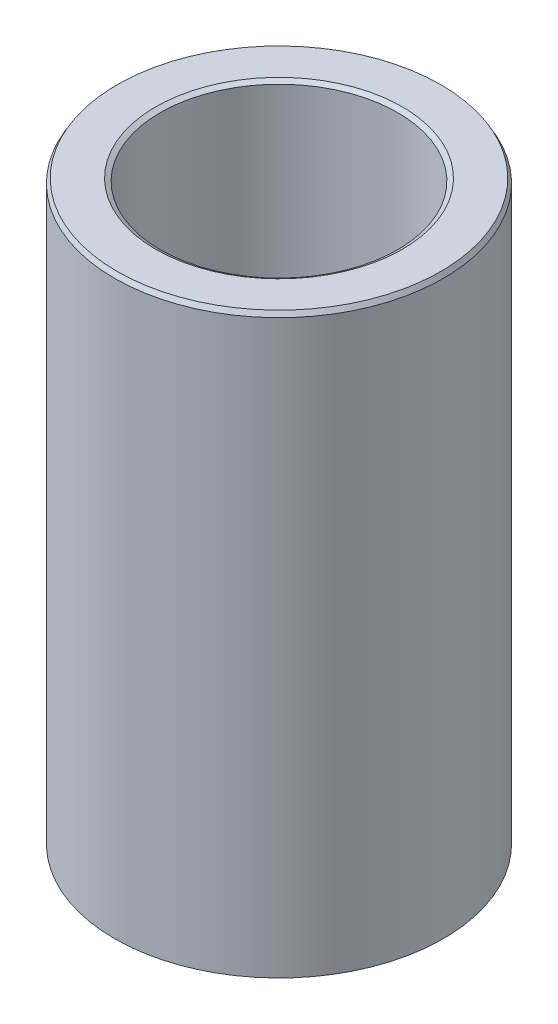
ISO-10303-21;
HEADER;
FILE_DESCRIPTION(('STEP AP214'),'2;1');
FILE_NAME('part.step','',(''),(''),'','','');
FILE_SCHEMA(('AUTOMOTIVE_DESIGN { 1 0 10303 214 1 1 1 1 }'));
ENDSEC;
DATA;
#1=APPLICATION_CONTEXT('core data for automotive mechanical design processes');
#2=APPLICATION_PROTOCOL_DEFINITION('international standard','automotive_design',2000,#1);
#3=PRODUCT_CONTEXT('',#1,'mechanical');
#4=PRODUCT('Part','Part','',(#3));
#5=PRODUCT_RELATED_PRODUCT_CATEGORY('part','',(#4));
#6=PRODUCT_DEFINITION_FORMATION('','',#4);
#7=PRODUCT_DEFINITION_CONTEXT('part definition',#1,'design');
#8=PRODUCT_DEFINITION('design','',#6,#7);
#9=PRODUCT_DEFINITION_SHAPE('','',#8);
#10=(LENGTH_UNIT() NAMED_UNIT(*) SI_UNIT(.MILLI.,.METRE.));
#11=(NAMED_UNIT(*) PLANE_ANGLE_UNIT() SI_UNIT($,.RADIAN.));
#12=(NAMED_UNIT(*) SI_UNIT($,.STERADIAN.) SOLID_ANGLE_UNIT());
#13=UNCERTAINTY_MEASURE_WITH_UNIT(LENGTH_MEASURE(1.E-05),#10,'distance_accuracy_value','');
#14=(GEOMETRIC_REPRESENTATION_CONTEXT(3) GLOBAL_UNCERTAINTY_ASSIGNED_CONTEXT((#13)) GLOBAL_UNIT_ASSIGNED_CONTEXT((#10,
#11,#12)) REPRESENTATION_CONTEXT('',''));
#15=CARTESIAN_POINT('',(0.,0.,0.));
#16=DIRECTION('',(0.,0.,1.));
#17=DIRECTION('',(1.,0.,0.));
#18=AXIS2_PLACEMENT_3D('',#15,#16,#17);
#19=CARTESIAN_POINT('',(0.,167.271061436816,0.));
#20=DIRECTION('',(0.,-1.,0.));
#21=DIRECTION('',(0.,0.,-1.));
#22=AXIS2_PLACEMENT_3D('',#19,#20,#21);
#23=CYLINDRICAL_SURFACE('',#22,47.5);
#24=CARTESIAN_POINT('',(0.,0.77125485827173,0.));
#25=DIRECTION('',(0.,1.,0.));
#26=DIRECTION('',(0.,0.,1.));
#27=AXIS2_PLACEMENT_3D('',#24,#25,#26);
#28=CIRCLE('',#27,47.5);
#29=CARTESIAN_POINT('',(0.,0.77125485827173,47.5));
#30=VERTEX_POINT('',#29);
#31=EDGE_CURVE('E10',#30,#30,#28,.T.);
#32=ORIENTED_EDGE('',*,*,#31,.T.);
#33=EDGE_LOOP('',(#32));
#34=FACE_BOUND('',#33,.T.);
#35=CARTESIAN_POINT('',(0.,165.935208836705,0.));
#36=DIRECTION('',(0.,1.,0.));
#37=DIRECTION('',(0.,0.,1.));
#38=AXIS2_PLACEMENT_3D('',#35,#36,#37);
#39=CIRCLE('',#38,47.5);
#40=CARTESIAN_POINT('',(0.,165.935208836705,47.5));
#41=VERTEX_POINT('',#40);
#42=EDGE_CURVE('E50',#41,#41,#39,.F.);
#43=ORIENTED_EDGE('',*,*,#42,.T.);
#44=EDGE_LOOP('',(#43));
#45=FACE_BOUND('',#44,.T.);
#46=ADVANCED_FACE('F39',(#34,#45),#23,.T.);
#47=CARTESIAN_POINT('',(0.,167.271061436816,0.));
#48=DIRECTION('',(0.,1.,0.));
#49=DIRECTION('',(0.,0.,1.));
#50=AXIS2_PLACEMENT_3D('',#47,#48,#49);
#51=PLANE('',#50);
#52=CARTESIAN_POINT('',(0.,167.271061436816,0.));
#53=DIRECTION('',(0.,1.,0.));
#54=DIRECTION('',(0.,0.,1.));
#55=AXIS2_PLACEMENT_3D('',#52,#53,#54);
#56=CIRCLE('',#55,35.6332214592748);
#57=CARTESIAN_POINT('',(0.,167.271061436816,35.6332214592748));
#58=VERTEX_POINT('',#57);
#59=EDGE_CURVE('E58',#58,#58,#56,.F.);
#60=ORIENTED_EDGE('',*,*,#59,.T.);
#61=EDGE_LOOP('',(#60));
#62=FACE_BOUND('',#61,.T.);
#63=CARTESIAN_POINT('',(0.,167.271061436816,0.));
#64=DIRECTION('',(0.,1.,0.));
#65=DIRECTION('',(0.,0.,1.));
#66=AXIS2_PLACEMENT_3D('',#63,#64,#65);
#67=CIRCLE('',#66,46.7287451417283);
#68=CARTESIAN_POINT('',(0.,167.271061436816,46.7287451417283));
#69=VERTEX_POINT('',#68);
#70=EDGE_CURVE('E61',#69,#69,#67,.T.);
#71=ORIENTED_EDGE('',*,*,#70,.T.);
#72=EDGE_LOOP('',(#71));
#73=FACE_BOUND('',#72,.T.);
#74=ADVANCED_FACE('F88',(#62,#73),#51,.T.);
#75=CARTESIAN_POINT('',(0.,0.,0.));
#76=DIRECTION('',(0.,1.,0.));
#77=DIRECTION('',(0.,0.,1.));
#78=AXIS2_PLACEMENT_3D('',#75,#76,#77);
#79=PLANE('',#78);
#80=CARTESIAN_POINT('',(0.,0.,0.));
#81=DIRECTION('',(0.,1.,0.));
#82=DIRECTION('',(0.,0.,1.));
#83=AXIS2_PLACEMENT_3D('',#80,#81,#82);
#84=CIRCLE('',#83,35.0686237174355);
#85=CARTESIAN_POINT('',(0.,0.,35.0686237174355));
#86=VERTEX_POINT('',#85);
#87=EDGE_CURVE('E51',#86,#86,#84,.T.);
#88=ORIENTED_EDGE('',*,*,#87,.T.);
#89=EDGE_LOOP('',(#88));
#90=FACE_BOUND('',#89,.T.);
#91=CARTESIAN_POINT('',(0.,0.,0.));
#92=DIRECTION('',(0.,1.,0.));
#93=DIRECTION('',(0.,0.,1.));
#94=AXIS2_PLACEMENT_3D('',#91,#92,#93);
#95=CIRCLE('',#94,46.1641473998891);
#96=CARTESIAN_POINT('',(0.,0.,46.1641473998891));
#97=VERTEX_POINT('',#96);
#98=EDGE_CURVE('E54',#97,#97,#95,.F.);
#99=ORIENTED_EDGE('',*,*,#98,.T.);
#100=EDGE_LOOP('',(#99));
#101=FACE_BOUND('',#100,.T.);
#102=ADVANCED_FACE('F83',(#90,#101),#79,.F.);
#103=CARTESIAN_POINT('',(0.,167.271061436816,0.));
#104=DIRECTION('',(0.,-1.,0.));
#105=DIRECTION('',(0.,0.,-1.));
#106=AXIS2_PLACEMENT_3D('',#103,#104,#105);
#107=CYLINDRICAL_SURFACE('',#106,34.2973688591638);
#108=CARTESIAN_POINT('',(0.,166.499806578544,0.));
#109=DIRECTION('',(0.,1.,0.));
#110=DIRECTION('',(0.,0.,1.));
#111=AXIS2_PLACEMENT_3D('',#108,#109,#110);
#112=CIRCLE('',#111,34.2973688591638);
#113=CARTESIAN_POINT('',(0.,166.499806578544,34.2973688591638));
#114=VERTEX_POINT('',#113);
#115=EDGE_CURVE('E67',#114,#114,#112,.T.);
#116=ORIENTED_EDGE('',*,*,#115,.T.);
#117=EDGE_LOOP('',(#116));
#118=FACE_BOUND('',#117,.T.);
#119=CARTESIAN_POINT('',(0.,1.33585260011096,0.));
#120=DIRECTION('',(0.,1.,0.));
#121=DIRECTION('',(0.,0.,1.));
#122=AXIS2_PLACEMENT_3D('',#119,#120,#121);
#123=CIRCLE('',#122,34.2973688591638);
#124=CARTESIAN_POINT('',(0.,1.33585260011096,34.2973688591638));
#125=VERTEX_POINT('',#124);
#126=EDGE_CURVE('E69',#125,#125,#123,.F.);
#127=ORIENTED_EDGE('',*,*,#126,.T.);
#128=EDGE_LOOP('',(#127));
#129=FACE_BOUND('',#128,.T.);
#130=ADVANCED_FACE('F71',(#118,#129),#107,.F.);
#131=CARTESIAN_POINT('',(0.,166.499806578544,0.));
#132=DIRECTION('',(0.,1.,0.));
#133=DIRECTION('',(0.,0.,1.));
#134=AXIS2_PLACEMENT_3D('',#131,#132,#133);
#135=CONICAL_SURFACE('',#134,34.2973688591638,1.0471975511966);
#136=ORIENTED_EDGE('',*,*,#59,.F.);
#137=EDGE_LOOP('',(#136));
#138=FACE_BOUND('',#137,.T.);
#139=ORIENTED_EDGE('',*,*,#115,.F.);
#140=EDGE_LOOP('',(#139));
#141=FACE_BOUND('',#140,.T.);
#142=ADVANCED_FACE('F77',(#138,#141),#135,.F.);
#143=CARTESIAN_POINT('',(0.,0.,0.));
#144=DIRECTION('',(0.,-1.,0.));
#145=DIRECTION('',(0.,0.,-1.));
#146=AXIS2_PLACEMENT_3D('',#143,#144,#145);
#147=CONICAL_SURFACE('',#146,35.0686237174355,0.523598775598291);
#148=ORIENTED_EDGE('',*,*,#126,.F.);
#149=EDGE_LOOP('',(#148));
#150=FACE_BOUND('',#149,.T.);
#151=ORIENTED_EDGE('',*,*,#87,.F.);
#152=EDGE_LOOP('',(#151));
#153=FACE_BOUND('',#152,.T.);
#154=ADVANCED_FACE('F73',(#150,#153),#147,.F.);
#155=CARTESIAN_POINT('',(0.,0.77125485827173,0.));
#156=DIRECTION('',(0.,1.,0.));
#157=DIRECTION('',(0.,0.,1.));
#158=AXIS2_PLACEMENT_3D('',#155,#156,#157);
#159=CONICAL_SURFACE('',#158,47.5,1.04719755119659);
#160=ORIENTED_EDGE('',*,*,#98,.F.);
#161=EDGE_LOOP('',(#160));
#162=FACE_BOUND('',#161,.T.);
#163=ORIENTED_EDGE('',*,*,#31,.F.);
#164=EDGE_LOOP('',(#163));
#165=FACE_BOUND('',#164,.T.);
#166=ADVANCED_FACE('F76',(#162,#165),#159,.T.);
#167=CARTESIAN_POINT('',(0.,167.271061436816,0.));
#168=DIRECTION('',(0.,-1.,0.));
#169=DIRECTION('',(0.,0.,-1.));
#170=AXIS2_PLACEMENT_3D('',#167,#168,#169);
#171=CONICAL_SURFACE('',#170,46.7287451417283,0.523598775598305);
#172=ORIENTED_EDGE('',*,*,#42,.F.);
#173=EDGE_LOOP('',(#172));
#174=FACE_BOUND('',#173,.T.);
#175=ORIENTED_EDGE('',*,*,#70,.F.);
#176=EDGE_LOOP('',(#175));
#177=FACE_BOUND('',#176,.T.);
#178=ADVANCED_FACE('F45',(#174,#177),#171,.T.);
#179=CLOSED_SHELL('',(#46,#74,#102,#130,#142,#154,#166,#178));
#180=MANIFOLD_SOLID_BREP('B2',#179);
#181=ADVANCED_BREP_SHAPE_REPRESENTATION('',(#18,#180),#14);
#182=SHAPE_DEFINITION_REPRESENTATION(#9,#181);
ENDSEC;
END-ISO-10303-21;
